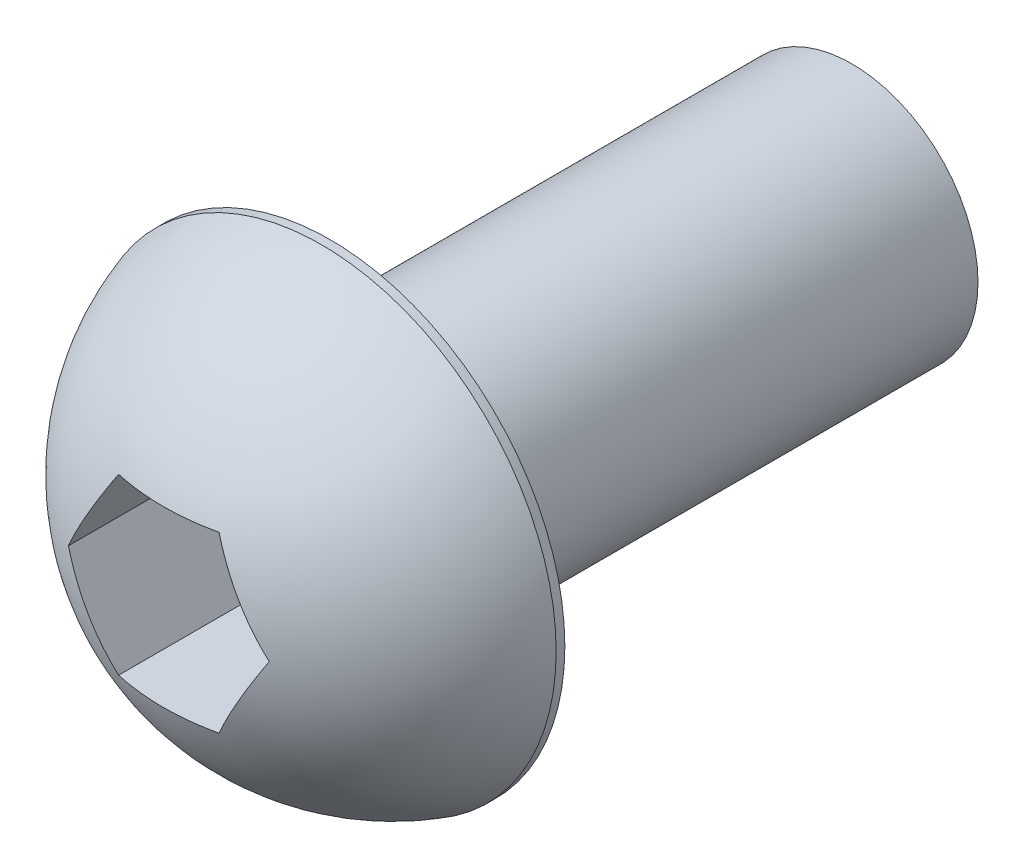
ISO-10303-21;
HEADER;
FILE_DESCRIPTION(('STEP AP214'),'2;1');
FILE_NAME('part.step','',(''),(''),'','','');
FILE_SCHEMA(('AUTOMOTIVE_DESIGN { 1 0 10303 214 1 1 1 1 }'));
ENDSEC;
DATA;
#1=APPLICATION_CONTEXT('core data for automotive mechanical design processes');
#2=APPLICATION_PROTOCOL_DEFINITION('international standard','automotive_design',2000,#1);
#3=PRODUCT_CONTEXT('',#1,'mechanical');
#4=PRODUCT('Part','Part','',(#3));
#5=PRODUCT_RELATED_PRODUCT_CATEGORY('part','',(#4));
#6=PRODUCT_DEFINITION_FORMATION('','',#4);
#7=PRODUCT_DEFINITION_CONTEXT('part definition',#1,'design');
#8=PRODUCT_DEFINITION('design','',#6,#7);
#9=PRODUCT_DEFINITION_SHAPE('','',#8);
#10=(LENGTH_UNIT() NAMED_UNIT(*) SI_UNIT(.MILLI.,.METRE.));
#11=(NAMED_UNIT(*) PLANE_ANGLE_UNIT() SI_UNIT($,.RADIAN.));
#12=(NAMED_UNIT(*) SI_UNIT($,.STERADIAN.) SOLID_ANGLE_UNIT());
#13=UNCERTAINTY_MEASURE_WITH_UNIT(LENGTH_MEASURE(1.E-05),#10,'distance_accuracy_value','');
#14=(GEOMETRIC_REPRESENTATION_CONTEXT(3) GLOBAL_UNCERTAINTY_ASSIGNED_CONTEXT((#13)) GLOBAL_UNIT_ASSIGNED_CONTEXT((#10,
#11,#12)) REPRESENTATION_CONTEXT('',''));
#15=CARTESIAN_POINT('',(0.,0.,0.));
#16=DIRECTION('',(0.,0.,1.));
#17=DIRECTION('',(1.,0.,0.));
#18=AXIS2_PLACEMENT_3D('',#15,#16,#17);
#19=CARTESIAN_POINT('',(0.,0.,6.));
#20=DIRECTION('',(0.,0.,-1.));
#21=DIRECTION('',(-1.,0.,0.));
#22=AXIS2_PLACEMENT_3D('',#19,#20,#21);
#23=CYLINDRICAL_SURFACE('',#22,1.45);
#24=CARTESIAN_POINT('',(0.,0.,6.));
#25=DIRECTION('',(0.,0.,1.));
#26=DIRECTION('',(1.,0.,0.));
#27=AXIS2_PLACEMENT_3D('',#24,#25,#26);
#28=CIRCLE('',#27,1.45);
#29=CARTESIAN_POINT('',(1.45,0.,6.));
#30=VERTEX_POINT('',#29);
#31=EDGE_CURVE('E127',#30,#30,#28,.T.);
#32=ORIENTED_EDGE('',*,*,#31,.F.);
#33=EDGE_LOOP('',(#32));
#34=FACE_BOUND('',#33,.T.);
#35=CARTESIAN_POINT('',(0.,0.,0.));
#36=DIRECTION('',(0.,0.,1.));
#37=DIRECTION('',(1.,0.,0.));
#38=AXIS2_PLACEMENT_3D('',#35,#36,#37);
#39=CIRCLE('',#38,1.45);
#40=CARTESIAN_POINT('',(1.45,0.,0.));
#41=VERTEX_POINT('',#40);
#42=EDGE_CURVE('E130',#41,#41,#39,.T.);
#43=ORIENTED_EDGE('',*,*,#42,.T.);
#44=EDGE_LOOP('',(#43));
#45=FACE_BOUND('',#44,.T.);
#46=ADVANCED_FACE('F34',(#34,#45),#23,.T.);
#47=CARTESIAN_POINT('',(0.,0.,0.));
#48=DIRECTION('',(0.,0.,1.));
#49=DIRECTION('',(1.,0.,0.));
#50=AXIS2_PLACEMENT_3D('',#47,#48,#49);
#51=PLANE('',#50);
#52=ORIENTED_EDGE('',*,*,#42,.F.);
#53=EDGE_LOOP('',(#52));
#54=FACE_BOUND('',#53,.T.);
#55=ADVANCED_FACE('F168',(#54),#51,.F.);
#56=CARTESIAN_POINT('',(0.,0.,6.));
#57=DIRECTION('',(0.,0.,1.));
#58=DIRECTION('',(1.,0.,0.));
#59=AXIS2_PLACEMENT_3D('',#56,#57,#58);
#60=PLANE('',#59);
#61=CARTESIAN_POINT('',(0.,0.,6.));
#62=DIRECTION('',(0.,0.,1.));
#63=DIRECTION('',(1.,0.,0.));
#64=AXIS2_PLACEMENT_3D('',#61,#62,#63);
#65=CIRCLE('',#64,2.7);
#66=CARTESIAN_POINT('',(2.7,0.,6.));
#67=VERTEX_POINT('',#66);
#68=EDGE_CURVE('E116',#67,#67,#65,.T.);
#69=ORIENTED_EDGE('',*,*,#68,.F.);
#70=EDGE_LOOP('',(#69));
#71=FACE_BOUND('',#70,.T.);
#72=ORIENTED_EDGE('',*,*,#31,.T.);
#73=EDGE_LOOP('',(#72));
#74=FACE_BOUND('',#73,.T.);
#75=ADVANCED_FACE('F173',(#71,#74),#60,.F.);
#76=CARTESIAN_POINT('',(0.,0.,6.1));
#77=DIRECTION('',(0.,0.,-1.));
#78=DIRECTION('',(-1.,0.,0.));
#79=AXIS2_PLACEMENT_3D('',#76,#77,#78);
#80=CYLINDRICAL_SURFACE('',#79,2.7);
#81=CARTESIAN_POINT('',(0.,0.,6.1));
#82=DIRECTION('',(0.,0.,1.));
#83=DIRECTION('',(1.,0.,0.));
#84=AXIS2_PLACEMENT_3D('',#81,#82,#83);
#85=CIRCLE('',#84,2.7);
#86=CARTESIAN_POINT('',(2.7,0.,6.1));
#87=VERTEX_POINT('',#86);
#88=EDGE_CURVE('E126',#87,#87,#85,.T.);
#89=ORIENTED_EDGE('',*,*,#88,.F.);
#90=EDGE_LOOP('',(#89));
#91=FACE_BOUND('',#90,.T.);
#92=ORIENTED_EDGE('',*,*,#68,.T.);
#93=EDGE_LOOP('',(#92));
#94=FACE_BOUND('',#93,.T.);
#95=ADVANCED_FACE('F179',(#91,#94),#80,.T.);
#96=CARTESIAN_POINT('',(0.,0.,5.2775));
#97=DIRECTION('',(0.,0.,1.));
#98=DIRECTION('',(1.,0.,0.));
#99=AXIS2_PLACEMENT_3D('',#96,#97,#98);
#100=SPHERICAL_SURFACE('',#99,2.8225);
#101=CARTESIAN_POINT('',(0.,1.,5.2775));
#102=DIRECTION('',(0.,1.,0.));
#103=DIRECTION('',(-1.,0.,0.));
#104=AXIS2_PLACEMENT_3D('',#101,#102,#103);
#105=CIRCLE('',#104,2.63941399746232);
#106=CARTESIAN_POINT('',(0.577350269189626,1.,7.85299469358154));
#107=VERTEX_POINT('',#106);
#108=CARTESIAN_POINT('',(-0.577350269189626,1.,7.85299469358154));
#109=VERTEX_POINT('',#108);
#110=EDGE_CURVE('E11',#107,#109,#105,.F.);
#111=ORIENTED_EDGE('',*,*,#110,.F.);
#112=CARTESIAN_POINT('',(0.866025403784438,0.5,5.2775));
#113=DIRECTION('',(0.866025403784438,0.5,0.));
#114=DIRECTION('',(-0.5,0.866025403784439,0.));
#115=AXIS2_PLACEMENT_3D('',#112,#113,#114);
#116=CIRCLE('',#115,2.63941399746232);
#117=CARTESIAN_POINT('',(1.15470053837925,0.,7.85299469358154));
#118=VERTEX_POINT('',#117);
#119=EDGE_CURVE('E88',#118,#107,#116,.F.);
#120=ORIENTED_EDGE('',*,*,#119,.F.);
#121=CARTESIAN_POINT('',(0.866025403784439,-0.5,5.2775));
#122=DIRECTION('',(0.866025403784439,-0.5,0.));
#123=DIRECTION('',(0.5,0.866025403784439,0.));
#124=AXIS2_PLACEMENT_3D('',#121,#122,#123);
#125=CIRCLE('',#124,2.63941399746232);
#126=CARTESIAN_POINT('',(0.577350269189626,-1.,7.85299469358154));
#127=VERTEX_POINT('',#126);
#128=EDGE_CURVE('E136',#127,#118,#125,.F.);
#129=ORIENTED_EDGE('',*,*,#128,.F.);
#130=CARTESIAN_POINT('',(0.,-1.,5.2775));
#131=DIRECTION('',(0.,-1.,0.));
#132=DIRECTION('',(0.,0.,-1.));
#133=AXIS2_PLACEMENT_3D('',#130,#131,#132);
#134=CIRCLE('',#133,2.63941399746232);
#135=CARTESIAN_POINT('',(-0.577350269189626,-1.,7.85299469358154));
#136=VERTEX_POINT('',#135);
#137=EDGE_CURVE('E138',#136,#127,#134,.F.);
#138=ORIENTED_EDGE('',*,*,#137,.F.);
#139=CARTESIAN_POINT('',(-0.866025403784439,-0.5,5.2775));
#140=DIRECTION('',(-0.866025403784439,-0.5,0.));
#141=DIRECTION('',(0.5,-0.866025403784439,0.));
#142=AXIS2_PLACEMENT_3D('',#139,#140,#141);
#143=CIRCLE('',#142,2.63941399746232);
#144=CARTESIAN_POINT('',(-1.15470053837925,0.,7.85299469358154));
#145=VERTEX_POINT('',#144);
#146=EDGE_CURVE('E140',#145,#136,#143,.F.);
#147=ORIENTED_EDGE('',*,*,#146,.F.);
#148=CARTESIAN_POINT('',(-0.866025403784439,0.5,5.2775));
#149=DIRECTION('',(-0.866025403784439,0.5,0.));
#150=DIRECTION('',(-0.5,-0.866025403784439,0.));
#151=AXIS2_PLACEMENT_3D('',#148,#149,#150);
#152=CIRCLE('',#151,2.63941399746232);
#153=EDGE_CURVE('E42',#109,#145,#152,.F.);
#154=ORIENTED_EDGE('',*,*,#153,.F.);
#155=EDGE_LOOP('',(#111,#120,#129,#138,#147,#154));
#156=FACE_BOUND('',#155,.T.);
#157=ORIENTED_EDGE('',*,*,#88,.T.);
#158=EDGE_LOOP('',(#157));
#159=FACE_BOUND('',#158,.T.);
#160=ADVANCED_FACE('F36',(#156,#159),#100,.T.);
#161=CARTESIAN_POINT('',(-0.577350269189626,1.,8.1));
#162=DIRECTION('',(0.,1.,0.));
#163=DIRECTION('',(-1.,0.,0.));
#164=AXIS2_PLACEMENT_3D('',#161,#162,#163);
#165=PLANE('',#164);
#166=ORIENTED_EDGE('',*,*,#110,.T.);
#167=DIRECTION('',(0.,0.,-1.));
#168=VECTOR('',#167,1.);
#169=CARTESIAN_POINT('',(-0.577350269189626,1.,8.1));
#170=LINE('',#169,#168);
#171=CARTESIAN_POINT('',(-0.577350269189626,1.,6.));
#172=VERTEX_POINT('',#171);
#173=EDGE_CURVE('E104',#109,#172,#170,.T.);
#174=ORIENTED_EDGE('',*,*,#173,.T.);
#175=DIRECTION('',(1.,0.,0.));
#176=VECTOR('',#175,1.);
#177=CARTESIAN_POINT('',(-0.577350269189626,1.,6.));
#178=LINE('',#177,#176);
#179=CARTESIAN_POINT('',(0.577350269189626,1.,6.));
#180=VERTEX_POINT('',#179);
#181=EDGE_CURVE('E97',#172,#180,#178,.T.);
#182=ORIENTED_EDGE('',*,*,#181,.T.);
#183=DIRECTION('',(0.,0.,-1.));
#184=VECTOR('',#183,1.);
#185=CARTESIAN_POINT('',(0.577350269189626,1.,8.1));
#186=LINE('',#185,#184);
#187=EDGE_CURVE('E83',#107,#180,#186,.T.);
#188=ORIENTED_EDGE('',*,*,#187,.F.);
#189=EDGE_LOOP('',(#166,#174,#182,#188));
#190=FACE_BOUND('',#189,.T.);
#191=ADVANCED_FACE('F103',(#190),#165,.F.);
#192=CARTESIAN_POINT('',(-1.15470053837925,0.,8.1));
#193=DIRECTION('',(-0.866025403784439,0.5,0.));
#194=DIRECTION('',(-0.5,-0.866025403784439,0.));
#195=AXIS2_PLACEMENT_3D('',#192,#193,#194);
#196=PLANE('',#195);
#197=ORIENTED_EDGE('',*,*,#153,.T.);
#198=DIRECTION('',(0.,0.,-1.));
#199=VECTOR('',#198,1.);
#200=CARTESIAN_POINT('',(-1.15470053837925,0.,8.1));
#201=LINE('',#200,#199);
#202=CARTESIAN_POINT('',(-1.15470053837925,0.,6.));
#203=VERTEX_POINT('',#202);
#204=EDGE_CURVE('E117',#145,#203,#201,.T.);
#205=ORIENTED_EDGE('',*,*,#204,.T.);
#206=DIRECTION('',(0.5,0.866025403784439,0.));
#207=VECTOR('',#206,1.);
#208=CARTESIAN_POINT('',(-1.15470053837925,0.,6.));
#209=LINE('',#208,#207);
#210=EDGE_CURVE('E90',#203,#172,#209,.T.);
#211=ORIENTED_EDGE('',*,*,#210,.T.);
#212=ORIENTED_EDGE('',*,*,#173,.F.);
#213=EDGE_LOOP('',(#197,#205,#211,#212));
#214=FACE_BOUND('',#213,.T.);
#215=ADVANCED_FACE('F144',(#214),#196,.F.);
#216=CARTESIAN_POINT('',(-0.577350269189626,-1.,8.1));
#217=DIRECTION('',(-0.866025403784439,-0.5,0.));
#218=DIRECTION('',(0.5,-0.866025403784439,0.));
#219=AXIS2_PLACEMENT_3D('',#216,#217,#218);
#220=PLANE('',#219);
#221=ORIENTED_EDGE('',*,*,#146,.T.);
#222=DIRECTION('',(0.,0.,-1.));
#223=VECTOR('',#222,1.);
#224=CARTESIAN_POINT('',(-0.577350269189626,-1.,8.1));
#225=LINE('',#224,#223);
#226=CARTESIAN_POINT('',(-0.577350269189626,-1.,6.));
#227=VERTEX_POINT('',#226);
#228=EDGE_CURVE('E119',#136,#227,#225,.T.);
#229=ORIENTED_EDGE('',*,*,#228,.T.);
#230=DIRECTION('',(-0.5,0.866025403784439,0.));
#231=VECTOR('',#230,1.);
#232=CARTESIAN_POINT('',(-0.577350269189626,-1.,6.));
#233=LINE('',#232,#231);
#234=EDGE_CURVE('E111',#227,#203,#233,.T.);
#235=ORIENTED_EDGE('',*,*,#234,.T.);
#236=ORIENTED_EDGE('',*,*,#204,.F.);
#237=EDGE_LOOP('',(#221,#229,#235,#236));
#238=FACE_BOUND('',#237,.T.);
#239=ADVANCED_FACE('F148',(#238),#220,.F.);
#240=CARTESIAN_POINT('',(0.577350269189626,-1.,8.1));
#241=DIRECTION('',(0.,-1.,0.));
#242=DIRECTION('',(0.,0.,-1.));
#243=AXIS2_PLACEMENT_3D('',#240,#241,#242);
#244=PLANE('',#243);
#245=ORIENTED_EDGE('',*,*,#137,.T.);
#246=DIRECTION('',(0.,0.,-1.));
#247=VECTOR('',#246,1.);
#248=CARTESIAN_POINT('',(0.577350269189626,-1.,8.1));
#249=LINE('',#248,#247);
#250=CARTESIAN_POINT('',(0.577350269189626,-1.,6.));
#251=VERTEX_POINT('',#250);
#252=EDGE_CURVE('E121',#127,#251,#249,.T.);
#253=ORIENTED_EDGE('',*,*,#252,.T.);
#254=DIRECTION('',(-1.,0.,0.));
#255=VECTOR('',#254,1.);
#256=CARTESIAN_POINT('',(0.577350269189626,-1.,6.));
#257=LINE('',#256,#255);
#258=EDGE_CURVE('E108',#251,#227,#257,.T.);
#259=ORIENTED_EDGE('',*,*,#258,.T.);
#260=ORIENTED_EDGE('',*,*,#228,.F.);
#261=EDGE_LOOP('',(#245,#253,#259,#260));
#262=FACE_BOUND('',#261,.T.);
#263=ADVANCED_FACE('F156',(#262),#244,.F.);
#264=CARTESIAN_POINT('',(1.15470053837925,0.,8.1));
#265=DIRECTION('',(0.866025403784439,-0.5,0.));
#266=DIRECTION('',(0.5,0.866025403784439,0.));
#267=AXIS2_PLACEMENT_3D('',#264,#265,#266);
#268=PLANE('',#267);
#269=ORIENTED_EDGE('',*,*,#128,.T.);
#270=DIRECTION('',(0.,0.,-1.));
#271=VECTOR('',#270,1.);
#272=CARTESIAN_POINT('',(1.15470053837925,0.,8.1));
#273=LINE('',#272,#271);
#274=CARTESIAN_POINT('',(1.15470053837925,0.,6.));
#275=VERTEX_POINT('',#274);
#276=EDGE_CURVE('E49',#118,#275,#273,.T.);
#277=ORIENTED_EDGE('',*,*,#276,.T.);
#278=DIRECTION('',(-0.5,-0.866025403784439,0.));
#279=VECTOR('',#278,1.);
#280=CARTESIAN_POINT('',(1.15470053837925,0.,6.));
#281=LINE('',#280,#279);
#282=EDGE_CURVE('E101',#275,#251,#281,.T.);
#283=ORIENTED_EDGE('',*,*,#282,.T.);
#284=ORIENTED_EDGE('',*,*,#252,.F.);
#285=EDGE_LOOP('',(#269,#277,#283,#284));
#286=FACE_BOUND('',#285,.T.);
#287=ADVANCED_FACE('F158',(#286),#268,.F.);
#288=CARTESIAN_POINT('',(0.577350269189626,1.,8.1));
#289=DIRECTION('',(0.866025403784438,0.5,0.));
#290=DIRECTION('',(-0.5,0.866025403784439,0.));
#291=AXIS2_PLACEMENT_3D('',#288,#289,#290);
#292=PLANE('',#291);
#293=ORIENTED_EDGE('',*,*,#119,.T.);
#294=ORIENTED_EDGE('',*,*,#187,.T.);
#295=DIRECTION('',(0.5,-0.866025403784438,0.));
#296=VECTOR('',#295,1.);
#297=CARTESIAN_POINT('',(0.577350269189626,1.,6.));
#298=LINE('',#297,#296);
#299=EDGE_CURVE('E86',#180,#275,#298,.T.);
#300=ORIENTED_EDGE('',*,*,#299,.T.);
#301=ORIENTED_EDGE('',*,*,#276,.F.);
#302=EDGE_LOOP('',(#293,#294,#300,#301));
#303=FACE_BOUND('',#302,.T.);
#304=ADVANCED_FACE('F85',(#303),#292,.F.);
#305=CARTESIAN_POINT('',(0.577350269189626,1.,6.));
#306=DIRECTION('',(0.,0.,-1.));
#307=DIRECTION('',(-1.,0.,0.));
#308=AXIS2_PLACEMENT_3D('',#305,#306,#307);
#309=PLANE('',#308);
#310=ORIENTED_EDGE('',*,*,#181,.F.);
#311=ORIENTED_EDGE('',*,*,#210,.F.);
#312=ORIENTED_EDGE('',*,*,#234,.F.);
#313=ORIENTED_EDGE('',*,*,#258,.F.);
#314=ORIENTED_EDGE('',*,*,#282,.F.);
#315=ORIENTED_EDGE('',*,*,#299,.F.);
#316=EDGE_LOOP('',(#310,#311,#312,#313,#314,#315));
#317=FACE_BOUND('',#316,.T.);
#318=ADVANCED_FACE('F95',(#317),#309,.F.);
#319=CLOSED_SHELL('',(#46,#55,#75,#95,#160,#191,#215,#239,#263,#287,#304,#318));
#320=MANIFOLD_SOLID_BREP('B2',#319);
#321=ADVANCED_BREP_SHAPE_REPRESENTATION('',(#18,#320),#14);
#322=SHAPE_DEFINITION_REPRESENTATION(#9,#321);
ENDSEC;
END-ISO-10303-21;
